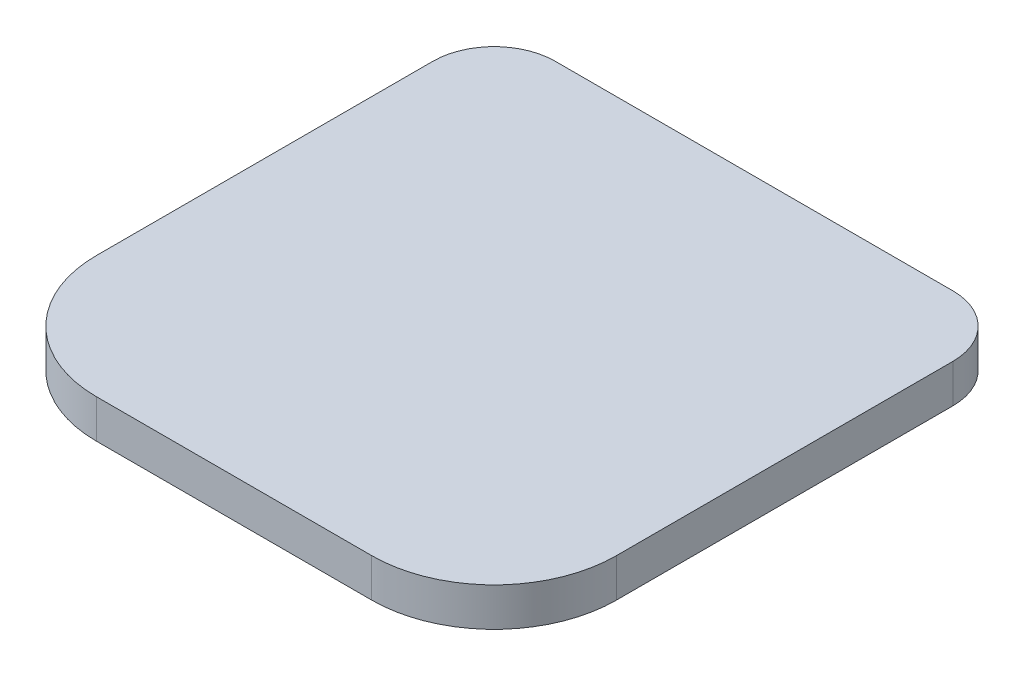
ISO-10303-21;
HEADER;
FILE_DESCRIPTION(('STEP AP214'),'2;1');
FILE_NAME('part.step','',(''),(''),'','','');
FILE_SCHEMA(('AUTOMOTIVE_DESIGN { 1 0 10303 214 1 1 1 1 }'));
ENDSEC;
DATA;
#1=APPLICATION_CONTEXT('core data for automotive mechanical design processes');
#2=APPLICATION_PROTOCOL_DEFINITION('international standard','automotive_design',2000,#1);
#3=PRODUCT_CONTEXT('',#1,'mechanical');
#4=PRODUCT('Part','Part','',(#3));
#5=PRODUCT_RELATED_PRODUCT_CATEGORY('part','',(#4));
#6=PRODUCT_DEFINITION_FORMATION('','',#4);
#7=PRODUCT_DEFINITION_CONTEXT('part definition',#1,'design');
#8=PRODUCT_DEFINITION('design','',#6,#7);
#9=PRODUCT_DEFINITION_SHAPE('','',#8);
#10=(LENGTH_UNIT() NAMED_UNIT(*) SI_UNIT(.MILLI.,.METRE.));
#11=(NAMED_UNIT(*) PLANE_ANGLE_UNIT() SI_UNIT($,.RADIAN.));
#12=(NAMED_UNIT(*) SI_UNIT($,.STERADIAN.) SOLID_ANGLE_UNIT());
#13=UNCERTAINTY_MEASURE_WITH_UNIT(LENGTH_MEASURE(1.E-05),#10,'distance_accuracy_value','');
#14=(GEOMETRIC_REPRESENTATION_CONTEXT(3) GLOBAL_UNCERTAINTY_ASSIGNED_CONTEXT((#13)) GLOBAL_UNIT_ASSIGNED_CONTEXT((#10,
#11,#12)) REPRESENTATION_CONTEXT('',''));
#15=CARTESIAN_POINT('',(0.,0.,0.));
#16=DIRECTION('',(0.,0.,1.));
#17=DIRECTION('',(1.,0.,0.));
#18=AXIS2_PLACEMENT_3D('',#15,#16,#17);
#19=CARTESIAN_POINT('',(0.,6.3,0.));
#20=DIRECTION('',(1.,0.,0.));
#21=DIRECTION('',(0.,0.,-1.));
#22=AXIS2_PLACEMENT_3D('',#19,#20,#21);
#23=PLANE('',#22);
#24=DIRECTION('',(0.,0.,1.));
#25=VECTOR('',#24,1.);
#26=CARTESIAN_POINT('',(0.,0.,0.));
#27=LINE('',#26,#25);
#28=CARTESIAN_POINT('',(0.,0.,-75.));
#29=VERTEX_POINT('',#28);
#30=CARTESIAN_POINT('',(0.,0.,-20.));
#31=VERTEX_POINT('',#30);
#32=EDGE_CURVE('E168',#29,#31,#27,.T.);
#33=ORIENTED_EDGE('',*,*,#32,.T.);
#34=DIRECTION('',(0.,-1.,0.));
#35=VECTOR('',#34,1.);
#36=CARTESIAN_POINT('',(0.,6.3,-20.));
#37=LINE('',#36,#35);
#38=CARTESIAN_POINT('',(0.,6.3,-20.));
#39=VERTEX_POINT('',#38);
#40=EDGE_CURVE('E56',#31,#39,#37,.F.);
#41=ORIENTED_EDGE('',*,*,#40,.T.);
#42=DIRECTION('',(0.,0.,1.));
#43=VECTOR('',#42,1.);
#44=CARTESIAN_POINT('',(0.,6.3,0.));
#45=LINE('',#44,#43);
#46=CARTESIAN_POINT('',(0.,6.3,-75.));
#47=VERTEX_POINT('',#46);
#48=EDGE_CURVE('E127',#47,#39,#45,.T.);
#49=ORIENTED_EDGE('',*,*,#48,.F.);
#50=DIRECTION('',(0.,-1.,0.));
#51=VECTOR('',#50,1.);
#52=CARTESIAN_POINT('',(0.,6.3,-75.));
#53=LINE('',#52,#51);
#54=EDGE_CURVE('E143',#47,#29,#53,.T.);
#55=ORIENTED_EDGE('',*,*,#54,.T.);
#56=EDGE_LOOP('',(#33,#41,#49,#55));
#57=FACE_BOUND('',#56,.T.);
#58=ADVANCED_FACE('F33',(#57),#23,.F.);
#59=CARTESIAN_POINT('',(0.,6.3,0.));
#60=DIRECTION('',(0.,0.,-1.));
#61=DIRECTION('',(-1.,0.,0.));
#62=AXIS2_PLACEMENT_3D('',#59,#60,#61);
#63=PLANE('',#62);
#64=DIRECTION('',(1.,0.,0.));
#65=VECTOR('',#64,1.);
#66=CARTESIAN_POINT('',(0.,6.3,0.));
#67=LINE('',#66,#65);
#68=CARTESIAN_POINT('',(20.,6.3,0.));
#69=VERTEX_POINT('',#68);
#70=CARTESIAN_POINT('',(65.,6.3,0.));
#71=VERTEX_POINT('',#70);
#72=EDGE_CURVE('E130',#69,#71,#67,.T.);
#73=ORIENTED_EDGE('',*,*,#72,.F.);
#74=DIRECTION('',(0.,-1.,0.));
#75=VECTOR('',#74,1.);
#76=CARTESIAN_POINT('',(20.,6.3,0.));
#77=LINE('',#76,#75);
#78=CARTESIAN_POINT('',(20.,0.,0.));
#79=VERTEX_POINT('',#78);
#80=EDGE_CURVE('E148',#69,#79,#77,.T.);
#81=ORIENTED_EDGE('',*,*,#80,.T.);
#82=DIRECTION('',(1.,0.,0.));
#83=VECTOR('',#82,1.);
#84=CARTESIAN_POINT('',(0.,0.,0.));
#85=LINE('',#84,#83);
#86=CARTESIAN_POINT('',(65.,0.,0.));
#87=VERTEX_POINT('',#86);
#88=EDGE_CURVE('E132',#79,#87,#85,.T.);
#89=ORIENTED_EDGE('',*,*,#88,.T.);
#90=DIRECTION('',(0.,-1.,0.));
#91=VECTOR('',#90,1.);
#92=CARTESIAN_POINT('',(65.,6.3,0.));
#93=LINE('',#92,#91);
#94=EDGE_CURVE('E146',#87,#71,#93,.F.);
#95=ORIENTED_EDGE('',*,*,#94,.T.);
#96=EDGE_LOOP('',(#73,#81,#89,#95));
#97=FACE_BOUND('',#96,.T.);
#98=ADVANCED_FACE('F162',(#97),#63,.F.);
#99=CARTESIAN_POINT('',(85.,6.3,0.));
#100=DIRECTION('',(-1.,0.,0.));
#101=DIRECTION('',(0.,0.,1.));
#102=AXIS2_PLACEMENT_3D('',#99,#100,#101);
#103=PLANE('',#102);
#104=DIRECTION('',(0.,0.,-1.));
#105=VECTOR('',#104,1.);
#106=CARTESIAN_POINT('',(85.,6.3,0.));
#107=LINE('',#106,#105);
#108=CARTESIAN_POINT('',(85.,6.3,-20.));
#109=VERTEX_POINT('',#108);
#110=CARTESIAN_POINT('',(85.,6.3,-75.));
#111=VERTEX_POINT('',#110);
#112=EDGE_CURVE('E165',#109,#111,#107,.T.);
#113=ORIENTED_EDGE('',*,*,#112,.F.);
#114=DIRECTION('',(0.,-1.,0.));
#115=VECTOR('',#114,1.);
#116=CARTESIAN_POINT('',(85.,6.3,-20.));
#117=LINE('',#116,#115);
#118=CARTESIAN_POINT('',(85.,0.,-20.));
#119=VERTEX_POINT('',#118);
#120=EDGE_CURVE('E11',#109,#119,#117,.T.);
#121=ORIENTED_EDGE('',*,*,#120,.T.);
#122=DIRECTION('',(0.,0.,-1.));
#123=VECTOR('',#122,1.);
#124=CARTESIAN_POINT('',(85.,0.,0.));
#125=LINE('',#124,#123);
#126=CARTESIAN_POINT('',(85.,0.,-75.));
#127=VERTEX_POINT('',#126);
#128=EDGE_CURVE('E128',#119,#127,#125,.T.);
#129=ORIENTED_EDGE('',*,*,#128,.T.);
#130=DIRECTION('',(0.,-1.,0.));
#131=VECTOR('',#130,1.);
#132=CARTESIAN_POINT('',(85.,6.3,-75.));
#133=LINE('',#132,#131);
#134=EDGE_CURVE('E108',#127,#111,#133,.F.);
#135=ORIENTED_EDGE('',*,*,#134,.T.);
#136=EDGE_LOOP('',(#113,#121,#129,#135));
#137=FACE_BOUND('',#136,.T.);
#138=ADVANCED_FACE('F175',(#137),#103,.F.);
#139=CARTESIAN_POINT('',(0.,6.3,-85.));
#140=DIRECTION('',(0.,0.,1.));
#141=DIRECTION('',(1.,0.,0.));
#142=AXIS2_PLACEMENT_3D('',#139,#140,#141);
#143=PLANE('',#142);
#144=DIRECTION('',(-1.,0.,0.));
#145=VECTOR('',#144,1.);
#146=CARTESIAN_POINT('',(0.,6.3,-85.));
#147=LINE('',#146,#145);
#148=CARTESIAN_POINT('',(75.,6.3,-85.));
#149=VERTEX_POINT('',#148);
#150=CARTESIAN_POINT('',(10.,6.3,-85.));
#151=VERTEX_POINT('',#150);
#152=EDGE_CURVE('E121',#149,#151,#147,.T.);
#153=ORIENTED_EDGE('',*,*,#152,.F.);
#154=DIRECTION('',(0.,-1.,0.));
#155=VECTOR('',#154,1.);
#156=CARTESIAN_POINT('',(75.,6.3,-85.));
#157=LINE('',#156,#155);
#158=CARTESIAN_POINT('',(75.,0.,-85.));
#159=VERTEX_POINT('',#158);
#160=EDGE_CURVE('E106',#149,#159,#157,.T.);
#161=ORIENTED_EDGE('',*,*,#160,.T.);
#162=DIRECTION('',(-1.,0.,0.));
#163=VECTOR('',#162,1.);
#164=CARTESIAN_POINT('',(0.,0.,-85.));
#165=LINE('',#164,#163);
#166=CARTESIAN_POINT('',(10.,0.,-85.));
#167=VERTEX_POINT('',#166);
#168=EDGE_CURVE('E118',#159,#167,#165,.T.);
#169=ORIENTED_EDGE('',*,*,#168,.T.);
#170=DIRECTION('',(0.,-1.,0.));
#171=VECTOR('',#170,1.);
#172=CARTESIAN_POINT('',(10.,6.3,-85.));
#173=LINE('',#172,#171);
#174=EDGE_CURVE('E122',#167,#151,#173,.F.);
#175=ORIENTED_EDGE('',*,*,#174,.T.);
#176=EDGE_LOOP('',(#153,#161,#169,#175));
#177=FACE_BOUND('',#176,.T.);
#178=ADVANCED_FACE('F117',(#177),#143,.F.);
#179=CARTESIAN_POINT('',(0.,6.3,0.));
#180=DIRECTION('',(0.,-1.,0.));
#181=DIRECTION('',(0.,0.,-1.));
#182=AXIS2_PLACEMENT_3D('',#179,#180,#181);
#183=PLANE('',#182);
#184=ORIENTED_EDGE('',*,*,#48,.T.);
#185=CARTESIAN_POINT('',(20.,6.3,-20.));
#186=DIRECTION('',(0.,-1.,0.));
#187=DIRECTION('',(0.,0.,-1.));
#188=AXIS2_PLACEMENT_3D('',#185,#186,#187);
#189=CIRCLE('',#188,20.);
#190=EDGE_CURVE('E41',#39,#69,#189,.F.);
#191=ORIENTED_EDGE('',*,*,#190,.T.);
#192=ORIENTED_EDGE('',*,*,#72,.T.);
#193=CARTESIAN_POINT('',(65.,6.3,-20.));
#194=DIRECTION('',(0.,-1.,0.));
#195=DIRECTION('',(0.,0.,-1.));
#196=AXIS2_PLACEMENT_3D('',#193,#194,#195);
#197=CIRCLE('',#196,20.);
#198=EDGE_CURVE('E48',#71,#109,#197,.F.);
#199=ORIENTED_EDGE('',*,*,#198,.T.);
#200=ORIENTED_EDGE('',*,*,#112,.T.);
#201=CARTESIAN_POINT('',(75.,6.3,-75.));
#202=DIRECTION('',(0.,-1.,0.));
#203=DIRECTION('',(0.,0.,-1.));
#204=AXIS2_PLACEMENT_3D('',#201,#202,#203);
#205=CIRCLE('',#204,10.);
#206=EDGE_CURVE('E141',#111,#149,#205,.F.);
#207=ORIENTED_EDGE('',*,*,#206,.T.);
#208=ORIENTED_EDGE('',*,*,#152,.T.);
#209=CARTESIAN_POINT('',(10.,6.3,-75.));
#210=DIRECTION('',(0.,-1.,0.));
#211=DIRECTION('',(0.,0.,-1.));
#212=AXIS2_PLACEMENT_3D('',#209,#210,#211);
#213=CIRCLE('',#212,10.);
#214=EDGE_CURVE('E139',#151,#47,#213,.F.);
#215=ORIENTED_EDGE('',*,*,#214,.T.);
#216=EDGE_LOOP('',(#184,#191,#192,#199,#200,#207,#208,#215));
#217=FACE_BOUND('',#216,.T.);
#218=ADVANCED_FACE('F158',(#217),#183,.F.);
#219=CARTESIAN_POINT('',(0.,0.,0.));
#220=DIRECTION('',(0.,-1.,0.));
#221=DIRECTION('',(0.,0.,-1.));
#222=AXIS2_PLACEMENT_3D('',#219,#220,#221);
#223=PLANE('',#222);
#224=ORIENTED_EDGE('',*,*,#88,.F.);
#225=CARTESIAN_POINT('',(20.,0.,-20.));
#226=DIRECTION('',(0.,-1.,0.));
#227=DIRECTION('',(0.,0.,-1.));
#228=AXIS2_PLACEMENT_3D('',#225,#226,#227);
#229=CIRCLE('',#228,20.);
#230=EDGE_CURVE('E153',#79,#31,#229,.T.);
#231=ORIENTED_EDGE('',*,*,#230,.T.);
#232=ORIENTED_EDGE('',*,*,#32,.F.);
#233=CARTESIAN_POINT('',(10.,0.,-75.));
#234=DIRECTION('',(0.,-1.,0.));
#235=DIRECTION('',(0.,0.,-1.));
#236=AXIS2_PLACEMENT_3D('',#233,#234,#235);
#237=CIRCLE('',#236,10.);
#238=EDGE_CURVE('E112',#29,#167,#237,.T.);
#239=ORIENTED_EDGE('',*,*,#238,.T.);
#240=ORIENTED_EDGE('',*,*,#168,.F.);
#241=CARTESIAN_POINT('',(75.,0.,-75.));
#242=DIRECTION('',(0.,-1.,0.));
#243=DIRECTION('',(0.,0.,-1.));
#244=AXIS2_PLACEMENT_3D('',#241,#242,#243);
#245=CIRCLE('',#244,10.);
#246=EDGE_CURVE('E102',#159,#127,#245,.T.);
#247=ORIENTED_EDGE('',*,*,#246,.T.);
#248=ORIENTED_EDGE('',*,*,#128,.F.);
#249=CARTESIAN_POINT('',(65.,0.,-20.));
#250=DIRECTION('',(0.,-1.,0.));
#251=DIRECTION('',(0.,0.,-1.));
#252=AXIS2_PLACEMENT_3D('',#249,#250,#251);
#253=CIRCLE('',#252,20.);
#254=EDGE_CURVE('E151',#119,#87,#253,.T.);
#255=ORIENTED_EDGE('',*,*,#254,.T.);
#256=EDGE_LOOP('',(#224,#231,#232,#239,#240,#247,#248,#255));
#257=FACE_BOUND('',#256,.T.);
#258=ADVANCED_FACE('F125',(#257),#223,.T.);
#259=CARTESIAN_POINT('',(75.,6.3,-75.));
#260=DIRECTION('',(0.,-1.,0.));
#261=DIRECTION('',(0.,0.,-1.));
#262=AXIS2_PLACEMENT_3D('',#259,#260,#261);
#263=CYLINDRICAL_SURFACE('',#262,10.);
#264=ORIENTED_EDGE('',*,*,#206,.F.);
#265=ORIENTED_EDGE('',*,*,#134,.F.);
#266=ORIENTED_EDGE('',*,*,#246,.F.);
#267=ORIENTED_EDGE('',*,*,#160,.F.);
#268=EDGE_LOOP('',(#264,#265,#266,#267));
#269=FACE_BOUND('',#268,.T.);
#270=ADVANCED_FACE('F105',(#269),#263,.T.);
#271=CARTESIAN_POINT('',(10.,6.3,-75.));
#272=DIRECTION('',(0.,-1.,0.));
#273=DIRECTION('',(0.,0.,-1.));
#274=AXIS2_PLACEMENT_3D('',#271,#272,#273);
#275=CYLINDRICAL_SURFACE('',#274,10.);
#276=ORIENTED_EDGE('',*,*,#214,.F.);
#277=ORIENTED_EDGE('',*,*,#174,.F.);
#278=ORIENTED_EDGE('',*,*,#238,.F.);
#279=ORIENTED_EDGE('',*,*,#54,.F.);
#280=EDGE_LOOP('',(#276,#277,#278,#279));
#281=FACE_BOUND('',#280,.T.);
#282=ADVANCED_FACE('F181',(#281),#275,.T.);
#283=CARTESIAN_POINT('',(20.,6.3,-20.));
#284=DIRECTION('',(0.,-1.,0.));
#285=DIRECTION('',(0.,0.,-1.));
#286=AXIS2_PLACEMENT_3D('',#283,#284,#285);
#287=CYLINDRICAL_SURFACE('',#286,20.);
#288=ORIENTED_EDGE('',*,*,#190,.F.);
#289=ORIENTED_EDGE('',*,*,#40,.F.);
#290=ORIENTED_EDGE('',*,*,#230,.F.);
#291=ORIENTED_EDGE('',*,*,#80,.F.);
#292=EDGE_LOOP('',(#288,#289,#290,#291));
#293=FACE_BOUND('',#292,.T.);
#294=ADVANCED_FACE('F167',(#293),#287,.T.);
#295=CARTESIAN_POINT('',(65.,6.3,-20.));
#296=DIRECTION('',(0.,-1.,0.));
#297=DIRECTION('',(0.,0.,-1.));
#298=AXIS2_PLACEMENT_3D('',#295,#296,#297);
#299=CYLINDRICAL_SURFACE('',#298,20.);
#300=ORIENTED_EDGE('',*,*,#198,.F.);
#301=ORIENTED_EDGE('',*,*,#94,.F.);
#302=ORIENTED_EDGE('',*,*,#254,.F.);
#303=ORIENTED_EDGE('',*,*,#120,.F.);
#304=EDGE_LOOP('',(#300,#301,#302,#303));
#305=FACE_BOUND('',#304,.T.);
#306=ADVANCED_FACE('F35',(#305),#299,.T.);
#307=CLOSED_SHELL('',(#58,#98,#138,#178,#218,#258,#270,#282,#294,#306));
#308=MANIFOLD_SOLID_BREP('B2',#307);
#309=ADVANCED_BREP_SHAPE_REPRESENTATION('',(#18,#308),#14);
#310=SHAPE_DEFINITION_REPRESENTATION(#9,#309);
ENDSEC;
END-ISO-10303-21;
